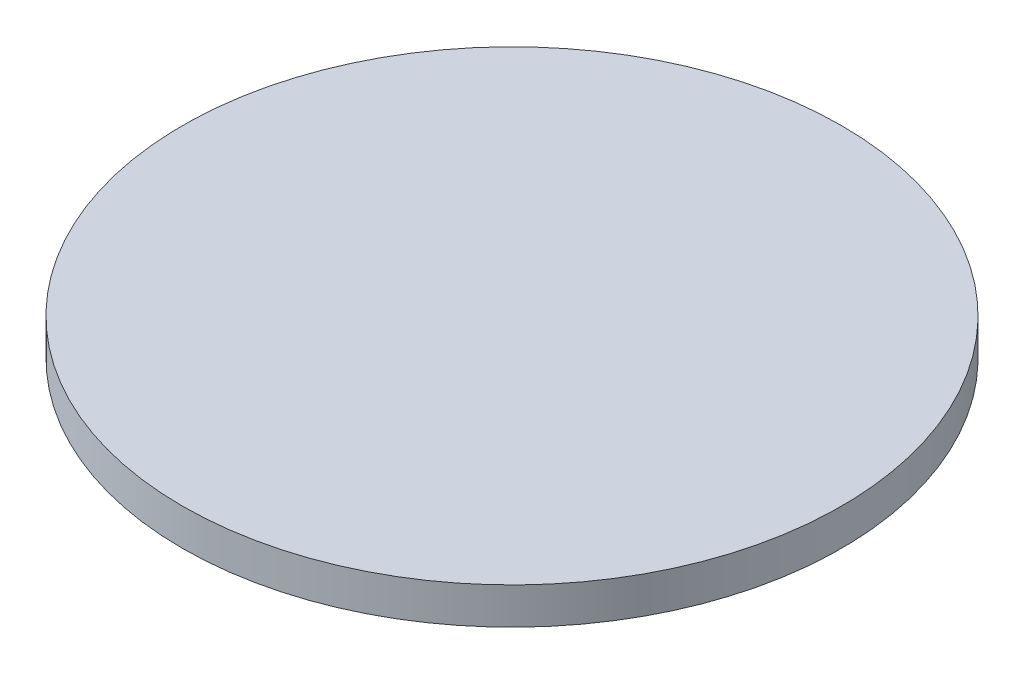
ISO-10303-21;
HEADER;
FILE_DESCRIPTION(('STEP AP214'),'2;1');
FILE_NAME('part.step','',(''),(''),'','','');
FILE_SCHEMA(('AUTOMOTIVE_DESIGN { 1 0 10303 214 1 1 1 1 }'));
ENDSEC;
DATA;
#1=APPLICATION_CONTEXT('core data for automotive mechanical design processes');
#2=APPLICATION_PROTOCOL_DEFINITION('international standard','automotive_design',2000,#1);
#3=PRODUCT_CONTEXT('',#1,'mechanical');
#4=PRODUCT('Part','Part','',(#3));
#5=PRODUCT_RELATED_PRODUCT_CATEGORY('part','',(#4));
#6=PRODUCT_DEFINITION_FORMATION('','',#4);
#7=PRODUCT_DEFINITION_CONTEXT('part definition',#1,'design');
#8=PRODUCT_DEFINITION('design','',#6,#7);
#9=PRODUCT_DEFINITION_SHAPE('','',#8);
#10=(LENGTH_UNIT() NAMED_UNIT(*) SI_UNIT(.MILLI.,.METRE.));
#11=(NAMED_UNIT(*) PLANE_ANGLE_UNIT() SI_UNIT($,.RADIAN.));
#12=(NAMED_UNIT(*) SI_UNIT($,.STERADIAN.) SOLID_ANGLE_UNIT());
#13=UNCERTAINTY_MEASURE_WITH_UNIT(LENGTH_MEASURE(1.E-05),#10,'distance_accuracy_value','');
#14=(GEOMETRIC_REPRESENTATION_CONTEXT(3) GLOBAL_UNCERTAINTY_ASSIGNED_CONTEXT((#13)) GLOBAL_UNIT_ASSIGNED_CONTEXT((#10,
#11,#12)) REPRESENTATION_CONTEXT('',''));
#15=CARTESIAN_POINT('',(0.,0.,0.));
#16=DIRECTION('',(0.,0.,1.));
#17=DIRECTION('',(1.,0.,0.));
#18=AXIS2_PLACEMENT_3D('',#15,#16,#17);
#19=CARTESIAN_POINT('',(0.,50.8,0.));
#20=DIRECTION('',(0.,-1.,0.));
#21=DIRECTION('',(0.,0.,-1.));
#22=AXIS2_PLACEMENT_3D('',#19,#20,#21);
#23=CYLINDRICAL_SURFACE('',#22,457.2);
#24=CARTESIAN_POINT('',(0.,50.8,0.));
#25=DIRECTION('',(0.,1.,0.));
#26=DIRECTION('',(0.,0.,1.));
#27=AXIS2_PLACEMENT_3D('',#24,#25,#26);
#28=CIRCLE('',#27,457.2);
#29=CARTESIAN_POINT('',(0.,50.8,457.2));
#30=VERTEX_POINT('',#29);
#31=EDGE_CURVE('E10',#30,#30,#28,.T.);
#32=ORIENTED_EDGE('',*,*,#31,.F.);
#33=EDGE_LOOP('',(#32));
#34=FACE_BOUND('',#33,.T.);
#35=CARTESIAN_POINT('',(0.,0.,0.));
#36=DIRECTION('',(0.,1.,0.));
#37=DIRECTION('',(0.,0.,1.));
#38=AXIS2_PLACEMENT_3D('',#35,#36,#37);
#39=CIRCLE('',#38,457.2);
#40=CARTESIAN_POINT('',(0.,0.,457.2));
#41=VERTEX_POINT('',#40);
#42=EDGE_CURVE('E36',#41,#41,#39,.T.);
#43=ORIENTED_EDGE('',*,*,#42,.T.);
#44=EDGE_LOOP('',(#43));
#45=FACE_BOUND('',#44,.T.);
#46=ADVANCED_FACE('F33',(#34,#45),#23,.T.);
#47=CARTESIAN_POINT('',(0.,50.8,0.));
#48=DIRECTION('',(0.,1.,0.));
#49=DIRECTION('',(0.,0.,1.));
#50=AXIS2_PLACEMENT_3D('',#47,#48,#49);
#51=PLANE('',#50);
#52=ORIENTED_EDGE('',*,*,#31,.T.);
#53=EDGE_LOOP('',(#52));
#54=FACE_BOUND('',#53,.T.);
#55=ADVANCED_FACE('F48',(#54),#51,.T.);
#56=CARTESIAN_POINT('',(0.,0.,0.));
#57=DIRECTION('',(0.,1.,0.));
#58=DIRECTION('',(0.,0.,1.));
#59=AXIS2_PLACEMENT_3D('',#56,#57,#58);
#60=PLANE('',#59);
#61=ORIENTED_EDGE('',*,*,#42,.F.);
#62=EDGE_LOOP('',(#61));
#63=FACE_BOUND('',#62,.T.);
#64=ADVANCED_FACE('F46',(#63),#60,.F.);
#65=CLOSED_SHELL('',(#46,#55,#64));
#66=MANIFOLD_SOLID_BREP('B2',#65);
#67=ADVANCED_BREP_SHAPE_REPRESENTATION('',(#18,#66),#14);
#68=SHAPE_DEFINITION_REPRESENTATION(#9,#67);
ENDSEC;
END-ISO-10303-21;
